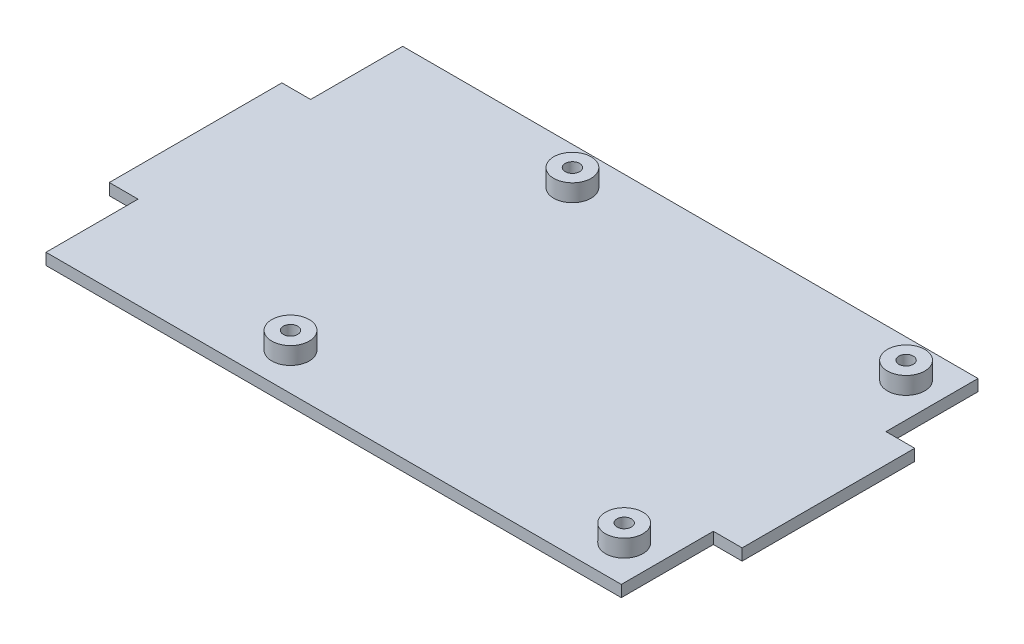
ISO-10303-21;
HEADER;
FILE_DESCRIPTION(('STEP AP214'),'2;1');
FILE_NAME('part.step','',(''),(''),'','','');
FILE_SCHEMA(('AUTOMOTIVE_DESIGN { 1 0 10303 214 1 1 1 1 }'));
ENDSEC;
DATA;
#1=APPLICATION_CONTEXT('core data for automotive mechanical design processes');
#2=APPLICATION_PROTOCOL_DEFINITION('international standard','automotive_design',2000,#1);
#3=PRODUCT_CONTEXT('',#1,'mechanical');
#4=PRODUCT('Part','Part','',(#3));
#5=PRODUCT_RELATED_PRODUCT_CATEGORY('part','',(#4));
#6=PRODUCT_DEFINITION_FORMATION('','',#4);
#7=PRODUCT_DEFINITION_CONTEXT('part definition',#1,'design');
#8=PRODUCT_DEFINITION('design','',#6,#7);
#9=PRODUCT_DEFINITION_SHAPE('','',#8);
#10=(LENGTH_UNIT() NAMED_UNIT(*) SI_UNIT(.MILLI.,.METRE.));
#11=(NAMED_UNIT(*) PLANE_ANGLE_UNIT() SI_UNIT($,.RADIAN.));
#12=(NAMED_UNIT(*) SI_UNIT($,.STERADIAN.) SOLID_ANGLE_UNIT());
#13=UNCERTAINTY_MEASURE_WITH_UNIT(LENGTH_MEASURE(1.E-05),#10,'distance_accuracy_value','');
#14=(GEOMETRIC_REPRESENTATION_CONTEXT(3) GLOBAL_UNCERTAINTY_ASSIGNED_CONTEXT((#13)) GLOBAL_UNIT_ASSIGNED_CONTEXT((#10,
#11,#12)) REPRESENTATION_CONTEXT('',''));
#15=CARTESIAN_POINT('',(0.,0.,0.));
#16=DIRECTION('',(0.,0.,1.));
#17=DIRECTION('',(1.,0.,0.));
#18=AXIS2_PLACEMENT_3D('',#15,#16,#17);
#19=CARTESIAN_POINT('',(0.,2.,0.));
#20=DIRECTION('',(0.,-1.,0.));
#21=DIRECTION('',(0.,0.,-1.));
#22=AXIS2_PLACEMENT_3D('',#19,#20,#21);
#23=PLANE('',#22);
#24=CARTESIAN_POINT('',(-14.,2.,24.5));
#25=DIRECTION('',(0.,-1.,0.));
#26=DIRECTION('',(0.,0.,-1.));
#27=AXIS2_PLACEMENT_3D('',#24,#25,#26);
#28=CIRCLE('',#27,3.25);
#29=CARTESIAN_POINT('',(-14.,2.,21.25));
#30=VERTEX_POINT('',#29);
#31=EDGE_CURVE('E68',#30,#30,#28,.F.);
#32=ORIENTED_EDGE('',*,*,#31,.F.);
#33=EDGE_LOOP('',(#32));
#34=FACE_BOUND('',#33,.T.);
#35=CARTESIAN_POINT('',(-14.,2.,-24.5));
#36=DIRECTION('',(0.,-1.,0.));
#37=DIRECTION('',(0.,0.,-1.));
#38=AXIS2_PLACEMENT_3D('',#35,#36,#37);
#39=CIRCLE('',#38,3.25);
#40=CARTESIAN_POINT('',(-14.,2.,-27.75));
#41=VERTEX_POINT('',#40);
#42=EDGE_CURVE('E162',#41,#41,#39,.F.);
#43=ORIENTED_EDGE('',*,*,#42,.F.);
#44=EDGE_LOOP('',(#43));
#45=FACE_BOUND('',#44,.T.);
#46=DIRECTION('',(1.,0.,0.));
#47=VECTOR('',#46,1.);
#48=CARTESIAN_POINT('',(-55.,2.,-15.));
#49=LINE('',#48,#47);
#50=CARTESIAN_POINT('',(50.,2.,-15.));
#51=VERTEX_POINT('',#50);
#52=CARTESIAN_POINT('',(55.,2.,-15.));
#53=VERTEX_POINT('',#52);
#54=EDGE_CURVE('E183',#51,#53,#49,.T.);
#55=ORIENTED_EDGE('',*,*,#54,.F.);
#56=DIRECTION('',(0.,0.,1.));
#57=VECTOR('',#56,1.);
#58=CARTESIAN_POINT('',(50.,2.,-31.));
#59=LINE('',#58,#57);
#60=CARTESIAN_POINT('',(50.,2.,-31.));
#61=VERTEX_POINT('',#60);
#62=EDGE_CURVE('E282',#61,#51,#59,.T.);
#63=ORIENTED_EDGE('',*,*,#62,.F.);
#64=DIRECTION('',(1.,0.,0.));
#65=VECTOR('',#64,1.);
#66=CARTESIAN_POINT('',(-50.,2.,-31.));
#67=LINE('',#66,#65);
#68=CARTESIAN_POINT('',(-50.,2.,-31.));
#69=VERTEX_POINT('',#68);
#70=EDGE_CURVE('E120',#69,#61,#67,.T.);
#71=ORIENTED_EDGE('',*,*,#70,.F.);
#72=DIRECTION('',(0.,0.,1.));
#73=VECTOR('',#72,1.);
#74=CARTESIAN_POINT('',(-50.,2.,-31.));
#75=LINE('',#74,#73);
#76=CARTESIAN_POINT('',(-50.,2.,-15.));
#77=VERTEX_POINT('',#76);
#78=EDGE_CURVE('E118',#69,#77,#75,.T.);
#79=ORIENTED_EDGE('',*,*,#78,.T.);
#80=CARTESIAN_POINT('',(-55.,2.,-15.));
#81=VERTEX_POINT('',#80);
#82=EDGE_CURVE('E321',#81,#77,#49,.T.);
#83=ORIENTED_EDGE('',*,*,#82,.F.);
#84=DIRECTION('',(0.,0.,1.));
#85=VECTOR('',#84,1.);
#86=CARTESIAN_POINT('',(-55.,2.,-15.));
#87=LINE('',#86,#85);
#88=CARTESIAN_POINT('',(-55.,2.,15.));
#89=VERTEX_POINT('',#88);
#90=EDGE_CURVE('E293',#81,#89,#87,.T.);
#91=ORIENTED_EDGE('',*,*,#90,.T.);
#92=DIRECTION('',(1.,0.,0.));
#93=VECTOR('',#92,1.);
#94=CARTESIAN_POINT('',(-55.,2.,15.));
#95=LINE('',#94,#93);
#96=CARTESIAN_POINT('',(-50.,2.,15.));
#97=VERTEX_POINT('',#96);
#98=EDGE_CURVE('E314',#89,#97,#95,.T.);
#99=ORIENTED_EDGE('',*,*,#98,.T.);
#100=CARTESIAN_POINT('',(-50.,2.,31.));
#101=VERTEX_POINT('',#100);
#102=EDGE_CURVE('E135',#97,#101,#75,.T.);
#103=ORIENTED_EDGE('',*,*,#102,.T.);
#104=DIRECTION('',(1.,0.,0.));
#105=VECTOR('',#104,1.);
#106=CARTESIAN_POINT('',(-50.,2.,31.));
#107=LINE('',#106,#105);
#108=CARTESIAN_POINT('',(50.,2.,31.));
#109=VERTEX_POINT('',#108);
#110=EDGE_CURVE('E286',#101,#109,#107,.T.);
#111=ORIENTED_EDGE('',*,*,#110,.T.);
#112=CARTESIAN_POINT('',(50.,2.,15.));
#113=VERTEX_POINT('',#112);
#114=EDGE_CURVE('E285',#113,#109,#59,.T.);
#115=ORIENTED_EDGE('',*,*,#114,.F.);
#116=CARTESIAN_POINT('',(55.,2.,15.));
#117=VERTEX_POINT('',#116);
#118=EDGE_CURVE('E317',#113,#117,#95,.T.);
#119=ORIENTED_EDGE('',*,*,#118,.T.);
#120=DIRECTION('',(0.,0.,1.));
#121=VECTOR('',#120,1.);
#122=CARTESIAN_POINT('',(55.,2.,-15.));
#123=LINE('',#122,#121);
#124=EDGE_CURVE('E318',#53,#117,#123,.T.);
#125=ORIENTED_EDGE('',*,*,#124,.F.);
#126=EDGE_LOOP('',(#55,#63,#71,#79,#83,#91,#99,#103,#111,#115,#119,#125));
#127=FACE_BOUND('',#126,.T.);
#128=CARTESIAN_POINT('',(44.,2.,-24.5));
#129=DIRECTION('',(0.,-1.,0.));
#130=DIRECTION('',(0.,0.,-1.));
#131=AXIS2_PLACEMENT_3D('',#128,#129,#130);
#132=CIRCLE('',#131,3.24999999999999);
#133=CARTESIAN_POINT('',(44.,2.,-27.75));
#134=VERTEX_POINT('',#133);
#135=EDGE_CURVE('E165',#134,#134,#132,.F.);
#136=ORIENTED_EDGE('',*,*,#135,.F.);
#137=EDGE_LOOP('',(#136));
#138=FACE_BOUND('',#137,.T.);
#139=CARTESIAN_POINT('',(44.,2.,24.5));
#140=DIRECTION('',(0.,-1.,0.));
#141=DIRECTION('',(0.,0.,-1.));
#142=AXIS2_PLACEMENT_3D('',#139,#140,#141);
#143=CIRCLE('',#142,3.25);
#144=CARTESIAN_POINT('',(44.,2.,21.25));
#145=VERTEX_POINT('',#144);
#146=EDGE_CURVE('E12',#145,#145,#143,.F.);
#147=ORIENTED_EDGE('',*,*,#146,.F.);
#148=EDGE_LOOP('',(#147));
#149=FACE_BOUND('',#148,.T.);
#150=ADVANCED_FACE('F59',(#34,#45,#127,#138,#149),#23,.F.);
#151=CARTESIAN_POINT('',(-55.,2.,15.));
#152=DIRECTION('',(0.,0.,-1.));
#153=DIRECTION('',(-1.,0.,0.));
#154=AXIS2_PLACEMENT_3D('',#151,#152,#153);
#155=PLANE('',#154);
#156=ORIENTED_EDGE('',*,*,#118,.F.);
#157=DIRECTION('',(0.,-1.,0.));
#158=VECTOR('',#157,1.);
#159=CARTESIAN_POINT('',(50.,2.,15.));
#160=LINE('',#159,#158);
#161=CARTESIAN_POINT('',(50.,0.,15.));
#162=VERTEX_POINT('',#161);
#163=EDGE_CURVE('E76',#113,#162,#160,.T.);
#164=ORIENTED_EDGE('',*,*,#163,.T.);
#165=DIRECTION('',(1.,0.,0.));
#166=VECTOR('',#165,1.);
#167=CARTESIAN_POINT('',(-55.,0.,15.));
#168=LINE('',#167,#166);
#169=CARTESIAN_POINT('',(55.,0.,15.));
#170=VERTEX_POINT('',#169);
#171=EDGE_CURVE('E307',#162,#170,#168,.T.);
#172=ORIENTED_EDGE('',*,*,#171,.T.);
#173=DIRECTION('',(0.,-1.,0.));
#174=VECTOR('',#173,1.);
#175=CARTESIAN_POINT('',(55.,2.,15.));
#176=LINE('',#175,#174);
#177=EDGE_CURVE('E292',#117,#170,#176,.T.);
#178=ORIENTED_EDGE('',*,*,#177,.F.);
#179=EDGE_LOOP('',(#156,#164,#172,#178));
#180=FACE_BOUND('',#179,.T.);
#181=ADVANCED_FACE('F174',(#180),#155,.F.);
#182=CARTESIAN_POINT('',(55.,2.,-15.));
#183=DIRECTION('',(1.,0.,0.));
#184=DIRECTION('',(0.,0.,-1.));
#185=AXIS2_PLACEMENT_3D('',#182,#183,#184);
#186=PLANE('',#185);
#187=DIRECTION('',(0.,0.,1.));
#188=VECTOR('',#187,1.);
#189=CARTESIAN_POINT('',(55.,0.,-15.));
#190=LINE('',#189,#188);
#191=CARTESIAN_POINT('',(55.,0.,-15.));
#192=VERTEX_POINT('',#191);
#193=EDGE_CURVE('E308',#192,#170,#190,.T.);
#194=ORIENTED_EDGE('',*,*,#193,.F.);
#195=DIRECTION('',(0.,-1.,0.));
#196=VECTOR('',#195,1.);
#197=CARTESIAN_POINT('',(55.,2.,-15.));
#198=LINE('',#197,#196);
#199=EDGE_CURVE('E289',#53,#192,#198,.T.);
#200=ORIENTED_EDGE('',*,*,#199,.F.);
#201=ORIENTED_EDGE('',*,*,#124,.T.);
#202=ORIENTED_EDGE('',*,*,#177,.T.);
#203=EDGE_LOOP('',(#194,#200,#201,#202));
#204=FACE_BOUND('',#203,.T.);
#205=ADVANCED_FACE('F250',(#204),#186,.T.);
#206=CARTESIAN_POINT('',(-55.,2.,-15.));
#207=DIRECTION('',(0.,0.,-1.));
#208=DIRECTION('',(-1.,0.,0.));
#209=AXIS2_PLACEMENT_3D('',#206,#207,#208);
#210=PLANE('',#209);
#211=DIRECTION('',(0.,-1.,0.));
#212=VECTOR('',#211,1.);
#213=CARTESIAN_POINT('',(50.,2.,-15.));
#214=LINE('',#213,#212);
#215=CARTESIAN_POINT('',(50.,0.,-15.));
#216=VERTEX_POINT('',#215);
#217=EDGE_CURVE('E154',#51,#216,#214,.T.);
#218=ORIENTED_EDGE('',*,*,#217,.F.);
#219=ORIENTED_EDGE('',*,*,#54,.T.);
#220=ORIENTED_EDGE('',*,*,#199,.T.);
#221=DIRECTION('',(1.,0.,0.));
#222=VECTOR('',#221,1.);
#223=CARTESIAN_POINT('',(-55.,0.,-15.));
#224=LINE('',#223,#222);
#225=EDGE_CURVE('E150',#216,#192,#224,.T.);
#226=ORIENTED_EDGE('',*,*,#225,.F.);
#227=EDGE_LOOP('',(#218,#219,#220,#226));
#228=FACE_BOUND('',#227,.T.);
#229=ADVANCED_FACE('F242',(#228),#210,.T.);
#230=CARTESIAN_POINT('',(0.,0.,0.));
#231=DIRECTION('',(0.,-1.,0.));
#232=DIRECTION('',(0.,0.,-1.));
#233=AXIS2_PLACEMENT_3D('',#230,#231,#232);
#234=PLANE('',#233);
#235=CARTESIAN_POINT('',(-14.,0.,24.5));
#236=DIRECTION('',(0.,1.,0.));
#237=DIRECTION('',(0.,0.,1.));
#238=AXIS2_PLACEMENT_3D('',#235,#236,#237);
#239=CIRCLE('',#238,1.25);
#240=CARTESIAN_POINT('',(-14.,0.,25.75));
#241=VERTEX_POINT('',#240);
#242=EDGE_CURVE('E327',#241,#241,#239,.T.);
#243=ORIENTED_EDGE('',*,*,#242,.T.);
#244=EDGE_LOOP('',(#243));
#245=FACE_BOUND('',#244,.T.);
#246=CARTESIAN_POINT('',(44.,0.,24.5));
#247=DIRECTION('',(0.,1.,0.));
#248=DIRECTION('',(0.,0.,1.));
#249=AXIS2_PLACEMENT_3D('',#246,#247,#248);
#250=CIRCLE('',#249,1.25);
#251=CARTESIAN_POINT('',(44.,0.,25.75));
#252=VERTEX_POINT('',#251);
#253=EDGE_CURVE('E331',#252,#252,#250,.T.);
#254=ORIENTED_EDGE('',*,*,#253,.T.);
#255=EDGE_LOOP('',(#254));
#256=FACE_BOUND('',#255,.T.);
#257=CARTESIAN_POINT('',(44.,0.,-24.5));
#258=DIRECTION('',(0.,1.,0.));
#259=DIRECTION('',(0.,0.,1.));
#260=AXIS2_PLACEMENT_3D('',#257,#258,#259);
#261=CIRCLE('',#260,1.25);
#262=CARTESIAN_POINT('',(44.,0.,-23.25));
#263=VERTEX_POINT('',#262);
#264=EDGE_CURVE('E328',#263,#263,#261,.T.);
#265=ORIENTED_EDGE('',*,*,#264,.T.);
#266=EDGE_LOOP('',(#265));
#267=FACE_BOUND('',#266,.T.);
#268=CARTESIAN_POINT('',(-14.,0.,-24.5));
#269=DIRECTION('',(0.,1.,0.));
#270=DIRECTION('',(0.,0.,1.));
#271=AXIS2_PLACEMENT_3D('',#268,#269,#270);
#272=CIRCLE('',#271,1.25);
#273=CARTESIAN_POINT('',(-14.,0.,-23.25));
#274=VERTEX_POINT('',#273);
#275=EDGE_CURVE('E324',#274,#274,#272,.T.);
#276=ORIENTED_EDGE('',*,*,#275,.T.);
#277=EDGE_LOOP('',(#276));
#278=FACE_BOUND('',#277,.T.);
#279=ORIENTED_EDGE('',*,*,#171,.F.);
#280=DIRECTION('',(0.,0.,1.));
#281=VECTOR('',#280,1.);
#282=CARTESIAN_POINT('',(50.,0.,-31.));
#283=LINE('',#282,#281);
#284=CARTESIAN_POINT('',(50.,0.,31.));
#285=VERTEX_POINT('',#284);
#286=EDGE_CURVE('E139',#162,#285,#283,.T.);
#287=ORIENTED_EDGE('',*,*,#286,.T.);
#288=DIRECTION('',(1.,0.,0.));
#289=VECTOR('',#288,1.);
#290=CARTESIAN_POINT('',(-50.,0.,31.));
#291=LINE('',#290,#289);
#292=CARTESIAN_POINT('',(-50.,0.,31.));
#293=VERTEX_POINT('',#292);
#294=EDGE_CURVE('E131',#293,#285,#291,.T.);
#295=ORIENTED_EDGE('',*,*,#294,.F.);
#296=DIRECTION('',(0.,0.,1.));
#297=VECTOR('',#296,1.);
#298=CARTESIAN_POINT('',(-50.,0.,-31.));
#299=LINE('',#298,#297);
#300=CARTESIAN_POINT('',(-50.,0.,15.));
#301=VERTEX_POINT('',#300);
#302=EDGE_CURVE('E132',#301,#293,#299,.T.);
#303=ORIENTED_EDGE('',*,*,#302,.F.);
#304=CARTESIAN_POINT('',(-55.,0.,15.));
#305=VERTEX_POINT('',#304);
#306=EDGE_CURVE('E304',#305,#301,#168,.T.);
#307=ORIENTED_EDGE('',*,*,#306,.F.);
#308=DIRECTION('',(0.,0.,1.));
#309=VECTOR('',#308,1.);
#310=CARTESIAN_POINT('',(-55.,0.,-15.));
#311=LINE('',#310,#309);
#312=CARTESIAN_POINT('',(-55.,0.,-15.));
#313=VERTEX_POINT('',#312);
#314=EDGE_CURVE('E301',#313,#305,#311,.T.);
#315=ORIENTED_EDGE('',*,*,#314,.F.);
#316=CARTESIAN_POINT('',(-50.,0.,-15.));
#317=VERTEX_POINT('',#316);
#318=EDGE_CURVE('E130',#313,#317,#224,.T.);
#319=ORIENTED_EDGE('',*,*,#318,.T.);
#320=CARTESIAN_POINT('',(-50.,0.,-31.));
#321=VERTEX_POINT('',#320);
#322=EDGE_CURVE('E115',#321,#317,#299,.T.);
#323=ORIENTED_EDGE('',*,*,#322,.F.);
#324=DIRECTION('',(1.,0.,0.));
#325=VECTOR('',#324,1.);
#326=CARTESIAN_POINT('',(-50.,0.,-31.));
#327=LINE('',#326,#325);
#328=CARTESIAN_POINT('',(50.,0.,-31.));
#329=VERTEX_POINT('',#328);
#330=EDGE_CURVE('E127',#321,#329,#327,.T.);
#331=ORIENTED_EDGE('',*,*,#330,.T.);
#332=EDGE_CURVE('E136',#329,#216,#283,.T.);
#333=ORIENTED_EDGE('',*,*,#332,.T.);
#334=ORIENTED_EDGE('',*,*,#225,.T.);
#335=ORIENTED_EDGE('',*,*,#193,.T.);
#336=EDGE_LOOP('',(#279,#287,#295,#303,#307,#315,#319,#323,#331,#333,#334,#335));
#337=FACE_BOUND('',#336,.T.);
#338=ADVANCED_FACE('F125',(#245,#256,#267,#278,#337),#234,.T.);
#339=CARTESIAN_POINT('',(-55.,2.,-15.));
#340=DIRECTION('',(1.,0.,0.));
#341=DIRECTION('',(0.,0.,-1.));
#342=AXIS2_PLACEMENT_3D('',#339,#340,#341);
#343=PLANE('',#342);
#344=ORIENTED_EDGE('',*,*,#314,.T.);
#345=DIRECTION('',(0.,-1.,0.));
#346=VECTOR('',#345,1.);
#347=CARTESIAN_POINT('',(-55.,2.,15.));
#348=LINE('',#347,#346);
#349=EDGE_CURVE('E296',#89,#305,#348,.T.);
#350=ORIENTED_EDGE('',*,*,#349,.F.);
#351=ORIENTED_EDGE('',*,*,#90,.F.);
#352=DIRECTION('',(0.,-1.,0.));
#353=VECTOR('',#352,1.);
#354=CARTESIAN_POINT('',(-55.,2.,-15.));
#355=LINE('',#354,#353);
#356=EDGE_CURVE('E153',#81,#313,#355,.T.);
#357=ORIENTED_EDGE('',*,*,#356,.T.);
#358=EDGE_LOOP('',(#344,#350,#351,#357));
#359=FACE_BOUND('',#358,.T.);
#360=ADVANCED_FACE('F241',(#359),#343,.F.);
#361=DIRECTION('',(0.,-1.,0.));
#362=VECTOR('',#361,1.);
#363=CARTESIAN_POINT('',(-50.,2.,15.));
#364=LINE('',#363,#362);
#365=EDGE_CURVE('E152',#97,#301,#364,.T.);
#366=ORIENTED_EDGE('',*,*,#365,.F.);
#367=ORIENTED_EDGE('',*,*,#98,.F.);
#368=ORIENTED_EDGE('',*,*,#349,.T.);
#369=ORIENTED_EDGE('',*,*,#306,.T.);
#370=EDGE_LOOP('',(#366,#367,#368,#369));
#371=FACE_BOUND('',#370,.T.);
#372=ADVANCED_FACE('F246',(#371),#155,.F.);
#373=ORIENTED_EDGE('',*,*,#82,.T.);
#374=DIRECTION('',(0.,-1.,0.));
#375=VECTOR('',#374,1.);
#376=CARTESIAN_POINT('',(-50.,2.,-15.));
#377=LINE('',#376,#375);
#378=EDGE_CURVE('E157',#77,#317,#377,.T.);
#379=ORIENTED_EDGE('',*,*,#378,.T.);
#380=ORIENTED_EDGE('',*,*,#318,.F.);
#381=ORIENTED_EDGE('',*,*,#356,.F.);
#382=EDGE_LOOP('',(#373,#379,#380,#381));
#383=FACE_BOUND('',#382,.T.);
#384=ADVANCED_FACE('F258',(#383),#210,.T.);
#385=CARTESIAN_POINT('',(-50.,2.,31.));
#386=DIRECTION('',(0.,0.,-1.));
#387=DIRECTION('',(-1.,0.,0.));
#388=AXIS2_PLACEMENT_3D('',#385,#386,#387);
#389=PLANE('',#388);
#390=ORIENTED_EDGE('',*,*,#294,.T.);
#391=DIRECTION('',(0.,-1.,0.));
#392=VECTOR('',#391,1.);
#393=CARTESIAN_POINT('',(50.,2.,31.));
#394=LINE('',#393,#392);
#395=EDGE_CURVE('E144',#109,#285,#394,.T.);
#396=ORIENTED_EDGE('',*,*,#395,.F.);
#397=ORIENTED_EDGE('',*,*,#110,.F.);
#398=DIRECTION('',(0.,-1.,0.));
#399=VECTOR('',#398,1.);
#400=CARTESIAN_POINT('',(-50.,2.,31.));
#401=LINE('',#400,#399);
#402=EDGE_CURVE('E147',#101,#293,#401,.T.);
#403=ORIENTED_EDGE('',*,*,#402,.T.);
#404=EDGE_LOOP('',(#390,#396,#397,#403));
#405=FACE_BOUND('',#404,.T.);
#406=ADVANCED_FACE('F266',(#405),#389,.F.);
#407=CARTESIAN_POINT('',(50.,2.,-31.));
#408=DIRECTION('',(1.,0.,0.));
#409=DIRECTION('',(0.,0.,-1.));
#410=AXIS2_PLACEMENT_3D('',#407,#408,#409);
#411=PLANE('',#410);
#412=ORIENTED_EDGE('',*,*,#163,.F.);
#413=ORIENTED_EDGE('',*,*,#114,.T.);
#414=ORIENTED_EDGE('',*,*,#395,.T.);
#415=ORIENTED_EDGE('',*,*,#286,.F.);
#416=EDGE_LOOP('',(#412,#413,#414,#415));
#417=FACE_BOUND('',#416,.T.);
#418=ADVANCED_FACE('F265',(#417),#411,.T.);
#419=CARTESIAN_POINT('',(-50.,2.,-31.));
#420=DIRECTION('',(1.,0.,0.));
#421=DIRECTION('',(0.,0.,-1.));
#422=AXIS2_PLACEMENT_3D('',#419,#420,#421);
#423=PLANE('',#422);
#424=ORIENTED_EDGE('',*,*,#102,.F.);
#425=ORIENTED_EDGE('',*,*,#365,.T.);
#426=ORIENTED_EDGE('',*,*,#302,.T.);
#427=ORIENTED_EDGE('',*,*,#402,.F.);
#428=EDGE_LOOP('',(#424,#425,#426,#427));
#429=FACE_BOUND('',#428,.T.);
#430=ADVANCED_FACE('F263',(#429),#423,.F.);
#431=ORIENTED_EDGE('',*,*,#62,.T.);
#432=ORIENTED_EDGE('',*,*,#217,.T.);
#433=ORIENTED_EDGE('',*,*,#332,.F.);
#434=DIRECTION('',(0.,-1.,0.));
#435=VECTOR('',#434,1.);
#436=CARTESIAN_POINT('',(50.,2.,-31.));
#437=LINE('',#436,#435);
#438=EDGE_CURVE('E105',#61,#329,#437,.T.);
#439=ORIENTED_EDGE('',*,*,#438,.F.);
#440=EDGE_LOOP('',(#431,#432,#433,#439));
#441=FACE_BOUND('',#440,.T.);
#442=ADVANCED_FACE('F261',(#441),#411,.T.);
#443=CARTESIAN_POINT('',(-50.,2.,-31.));
#444=DIRECTION('',(0.,0.,-1.));
#445=DIRECTION('',(-1.,0.,0.));
#446=AXIS2_PLACEMENT_3D('',#443,#444,#445);
#447=PLANE('',#446);
#448=ORIENTED_EDGE('',*,*,#330,.F.);
#449=DIRECTION('',(0.,-1.,0.));
#450=VECTOR('',#449,1.);
#451=CARTESIAN_POINT('',(-50.,2.,-31.));
#452=LINE('',#451,#450);
#453=EDGE_CURVE('E111',#69,#321,#452,.T.);
#454=ORIENTED_EDGE('',*,*,#453,.F.);
#455=ORIENTED_EDGE('',*,*,#70,.T.);
#456=ORIENTED_EDGE('',*,*,#438,.T.);
#457=EDGE_LOOP('',(#448,#454,#455,#456));
#458=FACE_BOUND('',#457,.T.);
#459=ADVANCED_FACE('F134',(#458),#447,.T.);
#460=ORIENTED_EDGE('',*,*,#378,.F.);
#461=ORIENTED_EDGE('',*,*,#78,.F.);
#462=ORIENTED_EDGE('',*,*,#453,.T.);
#463=ORIENTED_EDGE('',*,*,#322,.T.);
#464=EDGE_LOOP('',(#460,#461,#462,#463));
#465=FACE_BOUND('',#464,.T.);
#466=ADVANCED_FACE('F61',(#465),#423,.F.);
#467=CARTESIAN_POINT('',(-14.,0.,-24.5));
#468=DIRECTION('',(0.,1.,0.));
#469=DIRECTION('',(0.,0.,1.));
#470=AXIS2_PLACEMENT_3D('',#467,#468,#469);
#471=CYLINDRICAL_SURFACE('',#470,1.25);
#472=ORIENTED_EDGE('',*,*,#275,.F.);
#473=EDGE_LOOP('',(#472));
#474=FACE_BOUND('',#473,.T.);
#475=CARTESIAN_POINT('',(-14.,5.,-24.5));
#476=DIRECTION('',(0.,1.,0.));
#477=DIRECTION('',(0.,0.,1.));
#478=AXIS2_PLACEMENT_3D('',#475,#476,#477);
#479=CIRCLE('',#478,1.25);
#480=CARTESIAN_POINT('',(-14.,5.,-23.25));
#481=VERTEX_POINT('',#480);
#482=EDGE_CURVE('E339',#481,#481,#479,.T.);
#483=ORIENTED_EDGE('',*,*,#482,.T.);
#484=EDGE_LOOP('',(#483));
#485=FACE_BOUND('',#484,.T.);
#486=ADVANCED_FACE('F234',(#474,#485),#471,.F.);
#487=CARTESIAN_POINT('',(44.,0.,-24.5));
#488=DIRECTION('',(0.,1.,0.));
#489=DIRECTION('',(0.,0.,1.));
#490=AXIS2_PLACEMENT_3D('',#487,#488,#489);
#491=CYLINDRICAL_SURFACE('',#490,1.25);
#492=ORIENTED_EDGE('',*,*,#264,.F.);
#493=EDGE_LOOP('',(#492));
#494=FACE_BOUND('',#493,.T.);
#495=CARTESIAN_POINT('',(44.,5.,-24.5));
#496=DIRECTION('',(0.,1.,0.));
#497=DIRECTION('',(0.,0.,1.));
#498=AXIS2_PLACEMENT_3D('',#495,#496,#497);
#499=CIRCLE('',#498,1.25);
#500=CARTESIAN_POINT('',(44.,5.,-23.25));
#501=VERTEX_POINT('',#500);
#502=EDGE_CURVE('E345',#501,#501,#499,.T.);
#503=ORIENTED_EDGE('',*,*,#502,.T.);
#504=EDGE_LOOP('',(#503));
#505=FACE_BOUND('',#504,.T.);
#506=ADVANCED_FACE('F230',(#494,#505),#491,.F.);
#507=CARTESIAN_POINT('',(44.,0.,24.5));
#508=DIRECTION('',(0.,1.,0.));
#509=DIRECTION('',(0.,0.,1.));
#510=AXIS2_PLACEMENT_3D('',#507,#508,#509);
#511=CYLINDRICAL_SURFACE('',#510,1.25);
#512=ORIENTED_EDGE('',*,*,#253,.F.);
#513=EDGE_LOOP('',(#512));
#514=FACE_BOUND('',#513,.T.);
#515=CARTESIAN_POINT('',(44.,5.,24.5));
#516=DIRECTION('',(0.,1.,0.));
#517=DIRECTION('',(0.,0.,1.));
#518=AXIS2_PLACEMENT_3D('',#515,#516,#517);
#519=CIRCLE('',#518,1.25);
#520=CARTESIAN_POINT('',(44.,5.,25.75));
#521=VERTEX_POINT('',#520);
#522=EDGE_CURVE('E357',#521,#521,#519,.T.);
#523=ORIENTED_EDGE('',*,*,#522,.T.);
#524=EDGE_LOOP('',(#523));
#525=FACE_BOUND('',#524,.T.);
#526=ADVANCED_FACE('F226',(#514,#525),#511,.F.);
#527=CARTESIAN_POINT('',(-14.,0.,24.5));
#528=DIRECTION('',(0.,1.,0.));
#529=DIRECTION('',(0.,0.,1.));
#530=AXIS2_PLACEMENT_3D('',#527,#528,#529);
#531=CYLINDRICAL_SURFACE('',#530,1.25);
#532=ORIENTED_EDGE('',*,*,#242,.F.);
#533=EDGE_LOOP('',(#532));
#534=FACE_BOUND('',#533,.T.);
#535=CARTESIAN_POINT('',(-14.,5.,24.5));
#536=DIRECTION('',(0.,1.,0.));
#537=DIRECTION('',(0.,0.,1.));
#538=AXIS2_PLACEMENT_3D('',#535,#536,#537);
#539=CIRCLE('',#538,1.25);
#540=CARTESIAN_POINT('',(-14.,5.,25.75));
#541=VERTEX_POINT('',#540);
#542=EDGE_CURVE('E351',#541,#541,#539,.T.);
#543=ORIENTED_EDGE('',*,*,#542,.T.);
#544=EDGE_LOOP('',(#543));
#545=FACE_BOUND('',#544,.T.);
#546=ADVANCED_FACE('F219',(#534,#545),#531,.F.);
#547=CARTESIAN_POINT('',(-14.,5.,-24.5));
#548=DIRECTION('',(0.,1.,0.));
#549=DIRECTION('',(0.,0.,1.));
#550=AXIS2_PLACEMENT_3D('',#547,#548,#549);
#551=PLANE('',#550);
#552=CARTESIAN_POINT('',(-14.,5.,-24.5));
#553=DIRECTION('',(0.,1.,0.));
#554=DIRECTION('',(0.,0.,1.));
#555=AXIS2_PLACEMENT_3D('',#552,#553,#554);
#556=CIRCLE('',#555,3.25);
#557=CARTESIAN_POINT('',(-14.,5.,-21.25));
#558=VERTEX_POINT('',#557);
#559=EDGE_CURVE('E332',#558,#558,#556,.T.);
#560=ORIENTED_EDGE('',*,*,#559,.T.);
#561=EDGE_LOOP('',(#560));
#562=FACE_BOUND('',#561,.T.);
#563=ORIENTED_EDGE('',*,*,#482,.F.);
#564=EDGE_LOOP('',(#563));
#565=FACE_BOUND('',#564,.T.);
#566=ADVANCED_FACE('F216',(#562,#565),#551,.T.);
#567=CARTESIAN_POINT('',(-14.,5.,-24.5));
#568=DIRECTION('',(0.,-1.,0.));
#569=DIRECTION('',(0.,0.,-1.));
#570=AXIS2_PLACEMENT_3D('',#567,#568,#569);
#571=CYLINDRICAL_SURFACE('',#570,3.25);
#572=ORIENTED_EDGE('',*,*,#559,.F.);
#573=EDGE_LOOP('',(#572));
#574=FACE_BOUND('',#573,.T.);
#575=ORIENTED_EDGE('',*,*,#42,.T.);
#576=EDGE_LOOP('',(#575));
#577=FACE_BOUND('',#576,.T.);
#578=ADVANCED_FACE('F211',(#574,#577),#571,.T.);
#579=CARTESIAN_POINT('',(44.,5.,-24.5));
#580=DIRECTION('',(0.,1.,0.));
#581=DIRECTION('',(0.,0.,1.));
#582=AXIS2_PLACEMENT_3D('',#579,#580,#581);
#583=PLANE('',#582);
#584=CARTESIAN_POINT('',(44.,5.,-24.5));
#585=DIRECTION('',(0.,1.,0.));
#586=DIRECTION('',(0.,0.,1.));
#587=AXIS2_PLACEMENT_3D('',#584,#585,#586);
#588=CIRCLE('',#587,3.24999999999999);
#589=CARTESIAN_POINT('',(44.,5.,-21.25));
#590=VERTEX_POINT('',#589);
#591=EDGE_CURVE('E342',#590,#590,#588,.T.);
#592=ORIENTED_EDGE('',*,*,#591,.T.);
#593=EDGE_LOOP('',(#592));
#594=FACE_BOUND('',#593,.T.);
#595=ORIENTED_EDGE('',*,*,#502,.F.);
#596=EDGE_LOOP('',(#595));
#597=FACE_BOUND('',#596,.T.);
#598=ADVANCED_FACE('F208',(#594,#597),#583,.T.);
#599=CARTESIAN_POINT('',(44.,5.,-24.5));
#600=DIRECTION('',(0.,-1.,0.));
#601=DIRECTION('',(0.,0.,-1.));
#602=AXIS2_PLACEMENT_3D('',#599,#600,#601);
#603=CYLINDRICAL_SURFACE('',#602,3.24999999999999);
#604=ORIENTED_EDGE('',*,*,#591,.F.);
#605=EDGE_LOOP('',(#604));
#606=FACE_BOUND('',#605,.T.);
#607=ORIENTED_EDGE('',*,*,#135,.T.);
#608=EDGE_LOOP('',(#607));
#609=FACE_BOUND('',#608,.T.);
#610=ADVANCED_FACE('F203',(#606,#609),#603,.T.);
#611=CARTESIAN_POINT('',(-14.,5.,24.5));
#612=DIRECTION('',(0.,1.,0.));
#613=DIRECTION('',(0.,0.,1.));
#614=AXIS2_PLACEMENT_3D('',#611,#612,#613);
#615=PLANE('',#614);
#616=CARTESIAN_POINT('',(-14.,5.,24.5));
#617=DIRECTION('',(0.,1.,0.));
#618=DIRECTION('',(0.,0.,1.));
#619=AXIS2_PLACEMENT_3D('',#616,#617,#618);
#620=CIRCLE('',#619,3.25);
#621=CARTESIAN_POINT('',(-14.,5.,27.75));
#622=VERTEX_POINT('',#621);
#623=EDGE_CURVE('E348',#622,#622,#620,.T.);
#624=ORIENTED_EDGE('',*,*,#623,.T.);
#625=EDGE_LOOP('',(#624));
#626=FACE_BOUND('',#625,.T.);
#627=ORIENTED_EDGE('',*,*,#542,.F.);
#628=EDGE_LOOP('',(#627));
#629=FACE_BOUND('',#628,.T.);
#630=ADVANCED_FACE('F200',(#626,#629),#615,.T.);
#631=CARTESIAN_POINT('',(-14.,5.,24.5));
#632=DIRECTION('',(0.,-1.,0.));
#633=DIRECTION('',(0.,0.,-1.));
#634=AXIS2_PLACEMENT_3D('',#631,#632,#633);
#635=CYLINDRICAL_SURFACE('',#634,3.25);
#636=ORIENTED_EDGE('',*,*,#623,.F.);
#637=EDGE_LOOP('',(#636));
#638=FACE_BOUND('',#637,.T.);
#639=ORIENTED_EDGE('',*,*,#31,.T.);
#640=EDGE_LOOP('',(#639));
#641=FACE_BOUND('',#640,.T.);
#642=ADVANCED_FACE('F170',(#638,#641),#635,.T.);
#643=CARTESIAN_POINT('',(44.,5.,24.5));
#644=DIRECTION('',(0.,1.,0.));
#645=DIRECTION('',(0.,0.,1.));
#646=AXIS2_PLACEMENT_3D('',#643,#644,#645);
#647=PLANE('',#646);
#648=CARTESIAN_POINT('',(44.,5.,24.5));
#649=DIRECTION('',(0.,1.,0.));
#650=DIRECTION('',(0.,0.,1.));
#651=AXIS2_PLACEMENT_3D('',#648,#649,#650);
#652=CIRCLE('',#651,3.25);
#653=CARTESIAN_POINT('',(44.,5.,27.75));
#654=VERTEX_POINT('',#653);
#655=EDGE_CURVE('E354',#654,#654,#652,.T.);
#656=ORIENTED_EDGE('',*,*,#655,.T.);
#657=EDGE_LOOP('',(#656));
#658=FACE_BOUND('',#657,.T.);
#659=ORIENTED_EDGE('',*,*,#522,.F.);
#660=EDGE_LOOP('',(#659));
#661=FACE_BOUND('',#660,.T.);
#662=ADVANCED_FACE('F190',(#658,#661),#647,.T.);
#663=CARTESIAN_POINT('',(44.,5.,24.5));
#664=DIRECTION('',(0.,-1.,0.));
#665=DIRECTION('',(0.,0.,-1.));
#666=AXIS2_PLACEMENT_3D('',#663,#664,#665);
#667=CYLINDRICAL_SURFACE('',#666,3.25);
#668=ORIENTED_EDGE('',*,*,#655,.F.);
#669=EDGE_LOOP('',(#668));
#670=FACE_BOUND('',#669,.T.);
#671=ORIENTED_EDGE('',*,*,#146,.T.);
#672=EDGE_LOOP('',(#671));
#673=FACE_BOUND('',#672,.T.);
#674=ADVANCED_FACE('F188',(#670,#673),#667,.T.);
#675=CLOSED_SHELL('',(#150,#181,#205,#229,#338,#360,#372,#384,#406,#418,#430,#442,#459,#466,
#486,#506,#526,#546,#566,#578,#598,#610,#630,#642,#662,#674));
#676=MANIFOLD_SOLID_BREP('B2',#675);
#677=ADVANCED_BREP_SHAPE_REPRESENTATION('',(#18,#676),#14);
#678=SHAPE_DEFINITION_REPRESENTATION(#9,#677);
ENDSEC;
END-ISO-10303-21;
